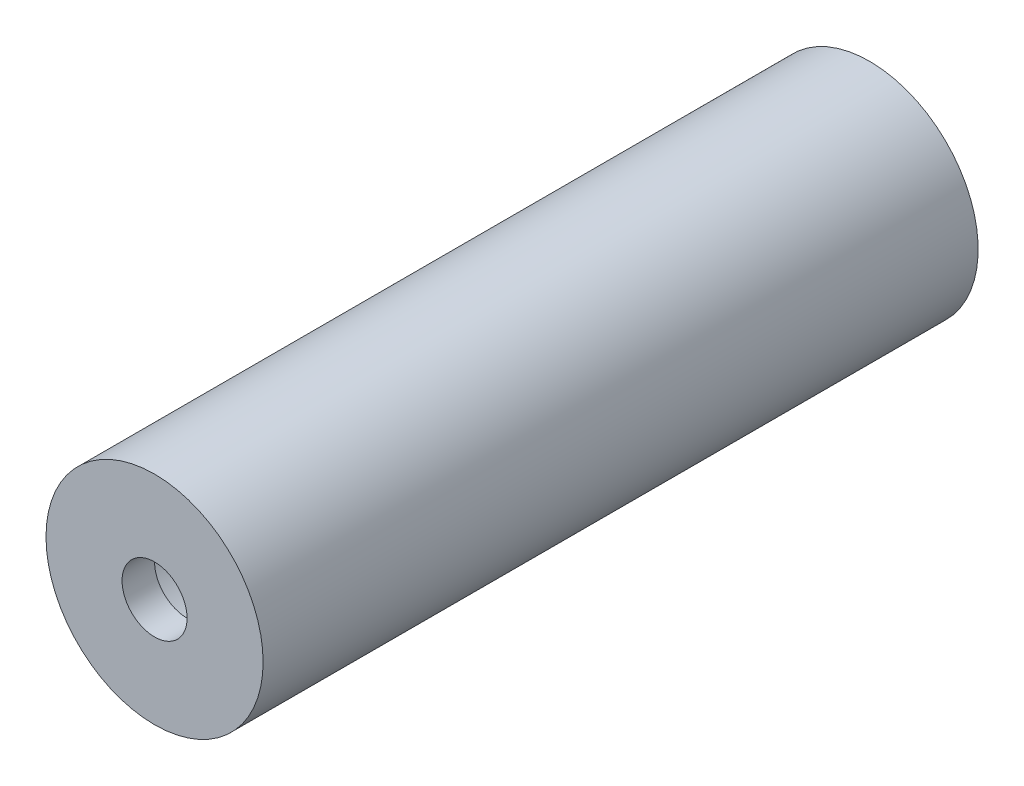
ISO-10303-21;
HEADER;
FILE_DESCRIPTION(('STEP AP214'),'2;1');
FILE_NAME('part.step','',(''),(''),'','','');
FILE_SCHEMA(('AUTOMOTIVE_DESIGN { 1 0 10303 214 1 1 1 1 }'));
ENDSEC;
DATA;
#1=APPLICATION_CONTEXT('core data for automotive mechanical design processes');
#2=APPLICATION_PROTOCOL_DEFINITION('international standard','automotive_design',2000,#1);
#3=PRODUCT_CONTEXT('',#1,'mechanical');
#4=PRODUCT('Part','Part','',(#3));
#5=PRODUCT_RELATED_PRODUCT_CATEGORY('part','',(#4));
#6=PRODUCT_DEFINITION_FORMATION('','',#4);
#7=PRODUCT_DEFINITION_CONTEXT('part definition',#1,'design');
#8=PRODUCT_DEFINITION('design','',#6,#7);
#9=PRODUCT_DEFINITION_SHAPE('','',#8);
#10=(LENGTH_UNIT() NAMED_UNIT(*) SI_UNIT(.MILLI.,.METRE.));
#11=(NAMED_UNIT(*) PLANE_ANGLE_UNIT() SI_UNIT($,.RADIAN.));
#12=(NAMED_UNIT(*) SI_UNIT($,.STERADIAN.) SOLID_ANGLE_UNIT());
#13=UNCERTAINTY_MEASURE_WITH_UNIT(LENGTH_MEASURE(1.E-05),#10,'distance_accuracy_value','');
#14=(GEOMETRIC_REPRESENTATION_CONTEXT(3) GLOBAL_UNCERTAINTY_ASSIGNED_CONTEXT((#13)) GLOBAL_UNIT_ASSIGNED_CONTEXT((#10,
#11,#12)) REPRESENTATION_CONTEXT('',''));
#15=CARTESIAN_POINT('',(0.,0.,0.));
#16=DIRECTION('',(0.,0.,1.));
#17=DIRECTION('',(1.,0.,0.));
#18=AXIS2_PLACEMENT_3D('',#15,#16,#17);
#19=CARTESIAN_POINT('',(0.,0.,100.));
#20=DIRECTION('',(0.,0.,-1.));
#21=DIRECTION('',(-1.,0.,0.));
#22=AXIS2_PLACEMENT_3D('',#19,#20,#21);
#23=CYLINDRICAL_SURFACE('',#22,16.7);
#24=CARTESIAN_POINT('',(0.,0.,-5.));
#25=DIRECTION('',(0.,0.,-1.));
#26=DIRECTION('',(-1.,0.,0.));
#27=AXIS2_PLACEMENT_3D('',#24,#25,#26);
#28=CIRCLE('',#27,16.7);
#29=CARTESIAN_POINT('',(-16.7,0.,-5.));
#30=VERTEX_POINT('',#29);
#31=EDGE_CURVE('E37',#30,#30,#28,.T.);
#32=ORIENTED_EDGE('',*,*,#31,.F.);
#33=EDGE_LOOP('',(#32));
#34=FACE_BOUND('',#33,.T.);
#35=CARTESIAN_POINT('',(0.,0.,105.));
#36=DIRECTION('',(0.,0.,1.));
#37=DIRECTION('',(1.,0.,0.));
#38=AXIS2_PLACEMENT_3D('',#35,#36,#37);
#39=CIRCLE('',#38,16.7);
#40=CARTESIAN_POINT('',(16.7,0.,105.));
#41=VERTEX_POINT('',#40);
#42=EDGE_CURVE('E45',#41,#41,#39,.T.);
#43=ORIENTED_EDGE('',*,*,#42,.F.);
#44=EDGE_LOOP('',(#43));
#45=FACE_BOUND('',#44,.T.);
#46=ADVANCED_FACE('F31',(#34,#45),#23,.T.);
#47=CARTESIAN_POINT('',(0.,0.,-5.));
#48=DIRECTION('',(0.,0.,-1.));
#49=DIRECTION('',(-1.,0.,0.));
#50=AXIS2_PLACEMENT_3D('',#47,#48,#49);
#51=PLANE('',#50);
#52=ORIENTED_EDGE('',*,*,#31,.T.);
#53=EDGE_LOOP('',(#52));
#54=FACE_BOUND('',#53,.T.);
#55=ADVANCED_FACE('F63',(#54),#51,.T.);
#56=CARTESIAN_POINT('',(0.,0.,105.));
#57=DIRECTION('',(0.,0.,1.));
#58=DIRECTION('',(1.,0.,0.));
#59=AXIS2_PLACEMENT_3D('',#56,#57,#58);
#60=PLANE('',#59);
#61=ORIENTED_EDGE('',*,*,#42,.T.);
#62=EDGE_LOOP('',(#61));
#63=FACE_BOUND('',#62,.T.);
#64=CARTESIAN_POINT('',(0.,0.,105.));
#65=DIRECTION('',(0.,0.,1.));
#66=DIRECTION('',(1.,0.,0.));
#67=AXIS2_PLACEMENT_3D('',#64,#65,#66);
#68=CIRCLE('',#67,5.);
#69=CARTESIAN_POINT('',(5.,0.,105.));
#70=VERTEX_POINT('',#69);
#71=EDGE_CURVE('E50',#70,#70,#68,.T.);
#72=ORIENTED_EDGE('',*,*,#71,.F.);
#73=EDGE_LOOP('',(#72));
#74=FACE_BOUND('',#73,.T.);
#75=ADVANCED_FACE('F60',(#63,#74),#60,.T.);
#76=CARTESIAN_POINT('',(0.,0.,100.));
#77=DIRECTION('',(0.,0.,1.));
#78=DIRECTION('',(1.,0.,0.));
#79=AXIS2_PLACEMENT_3D('',#76,#77,#78);
#80=PLANE('',#79);
#81=CARTESIAN_POINT('',(0.,0.,100.));
#82=DIRECTION('',(0.,0.,1.));
#83=DIRECTION('',(1.,0.,0.));
#84=AXIS2_PLACEMENT_3D('',#81,#82,#83);
#85=CIRCLE('',#84,12.85);
#86=CARTESIAN_POINT('',(12.85,0.,100.));
#87=VERTEX_POINT('',#86);
#88=EDGE_CURVE('E41',#87,#87,#85,.T.);
#89=ORIENTED_EDGE('',*,*,#88,.F.);
#90=EDGE_LOOP('',(#89));
#91=FACE_BOUND('',#90,.T.);
#92=CARTESIAN_POINT('',(0.,0.,100.));
#93=DIRECTION('',(0.,0.,1.));
#94=DIRECTION('',(1.,0.,0.));
#95=AXIS2_PLACEMENT_3D('',#92,#93,#94);
#96=CIRCLE('',#95,5.);
#97=CARTESIAN_POINT('',(5.,0.,100.));
#98=VERTEX_POINT('',#97);
#99=EDGE_CURVE('E51',#98,#98,#96,.T.);
#100=ORIENTED_EDGE('',*,*,#99,.T.);
#101=EDGE_LOOP('',(#100));
#102=FACE_BOUND('',#101,.T.);
#103=ADVANCED_FACE('F62',(#91,#102),#80,.F.);
#104=CARTESIAN_POINT('',(0.,0.,105.));
#105=DIRECTION('',(0.,0.,-1.));
#106=DIRECTION('',(-1.,0.,0.));
#107=AXIS2_PLACEMENT_3D('',#104,#105,#106);
#108=CYLINDRICAL_SURFACE('',#107,5.);
#109=ORIENTED_EDGE('',*,*,#71,.T.);
#110=EDGE_LOOP('',(#109));
#111=FACE_BOUND('',#110,.T.);
#112=ORIENTED_EDGE('',*,*,#99,.F.);
#113=EDGE_LOOP('',(#112));
#114=FACE_BOUND('',#113,.T.);
#115=ADVANCED_FACE('F57',(#111,#114),#108,.F.);
#116=CARTESIAN_POINT('',(0.,0.,0.));
#117=DIRECTION('',(0.,0.,-1.));
#118=DIRECTION('',(-1.,0.,0.));
#119=AXIS2_PLACEMENT_3D('',#116,#117,#118);
#120=PLANE('',#119);
#121=CARTESIAN_POINT('',(0.,0.,0.));
#122=DIRECTION('',(0.,0.,1.));
#123=DIRECTION('',(1.,0.,0.));
#124=AXIS2_PLACEMENT_3D('',#121,#122,#123);
#125=CIRCLE('',#124,12.85);
#126=CARTESIAN_POINT('',(12.85,0.,0.));
#127=VERTEX_POINT('',#126);
#128=EDGE_CURVE('E10',#127,#127,#125,.T.);
#129=ORIENTED_EDGE('',*,*,#128,.T.);
#130=EDGE_LOOP('',(#129));
#131=FACE_BOUND('',#130,.T.);
#132=ADVANCED_FACE('F94',(#131),#120,.F.);
#133=CARTESIAN_POINT('',(0.,0.,100.));
#134=DIRECTION('',(0.,0.,-1.));
#135=DIRECTION('',(-1.,0.,0.));
#136=AXIS2_PLACEMENT_3D('',#133,#134,#135);
#137=CYLINDRICAL_SURFACE('',#136,12.85);
#138=ORIENTED_EDGE('',*,*,#88,.T.);
#139=EDGE_LOOP('',(#138));
#140=FACE_BOUND('',#139,.T.);
#141=ORIENTED_EDGE('',*,*,#128,.F.);
#142=EDGE_LOOP('',(#141));
#143=FACE_BOUND('',#142,.T.);
#144=ADVANCED_FACE('F84',(#140,#143),#137,.F.);
#145=CLOSED_SHELL('',(#46,#55,#75,#103,#115,#132,#144));
#146=MANIFOLD_SOLID_BREP('B2',#145);
#147=ADVANCED_BREP_SHAPE_REPRESENTATION('',(#18,#146),#14);
#148=SHAPE_DEFINITION_REPRESENTATION(#9,#147);
ENDSEC;
END-ISO-10303-21;
